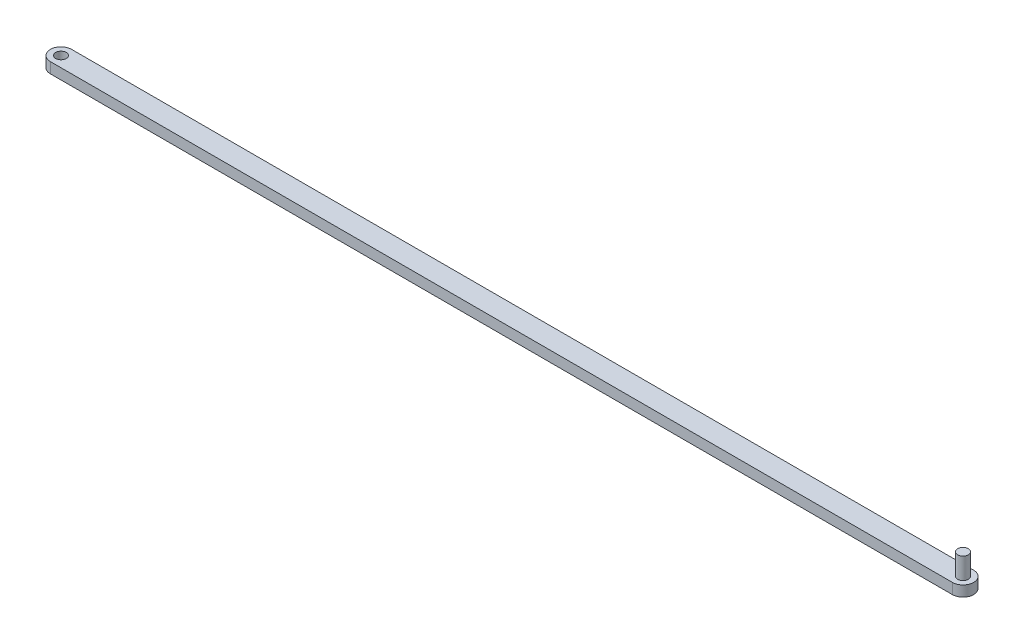
ISO-10303-21;
HEADER;
FILE_DESCRIPTION(('STEP AP214'),'2;1');
FILE_NAME('part.step','',(''),(''),'','','');
FILE_SCHEMA(('AUTOMOTIVE_DESIGN { 1 0 10303 214 1 1 1 1 }'));
ENDSEC;
DATA;
#1=APPLICATION_CONTEXT('core data for automotive mechanical design processes');
#2=APPLICATION_PROTOCOL_DEFINITION('international standard','automotive_design',2000,#1);
#3=PRODUCT_CONTEXT('',#1,'mechanical');
#4=PRODUCT('Part','Part','',(#3));
#5=PRODUCT_RELATED_PRODUCT_CATEGORY('part','',(#4));
#6=PRODUCT_DEFINITION_FORMATION('','',#4);
#7=PRODUCT_DEFINITION_CONTEXT('part definition',#1,'design');
#8=PRODUCT_DEFINITION('design','',#6,#7);
#9=PRODUCT_DEFINITION_SHAPE('','',#8);
#10=(LENGTH_UNIT() NAMED_UNIT(*) SI_UNIT(.MILLI.,.METRE.));
#11=(NAMED_UNIT(*) PLANE_ANGLE_UNIT() SI_UNIT($,.RADIAN.));
#12=(NAMED_UNIT(*) SI_UNIT($,.STERADIAN.) SOLID_ANGLE_UNIT());
#13=UNCERTAINTY_MEASURE_WITH_UNIT(LENGTH_MEASURE(1.E-05),#10,'distance_accuracy_value','');
#14=(GEOMETRIC_REPRESENTATION_CONTEXT(3) GLOBAL_UNCERTAINTY_ASSIGNED_CONTEXT((#13)) GLOBAL_UNIT_ASSIGNED_CONTEXT((#10,
#11,#12)) REPRESENTATION_CONTEXT('',''));
#15=CARTESIAN_POINT('',(0.,0.,0.));
#16=DIRECTION('',(0.,0.,1.));
#17=DIRECTION('',(1.,0.,0.));
#18=AXIS2_PLACEMENT_3D('',#15,#16,#17);
#19=CARTESIAN_POINT('',(-425.,-10.,0.));
#20=DIRECTION('',(0.,1.,0.));
#21=DIRECTION('',(0.,0.,1.));
#22=AXIS2_PLACEMENT_3D('',#19,#20,#21);
#23=CYLINDRICAL_SURFACE('',#22,10.);
#24=CARTESIAN_POINT('',(-425.,0.,0.));
#25=DIRECTION('',(0.,1.,0.));
#26=DIRECTION('',(0.,0.,1.));
#27=AXIS2_PLACEMENT_3D('',#24,#25,#26);
#28=CIRCLE('',#27,10.);
#29=CARTESIAN_POINT('',(-425.,0.,-10.));
#30=VERTEX_POINT('',#29);
#31=CARTESIAN_POINT('',(-425.,0.,10.));
#32=VERTEX_POINT('',#31);
#33=EDGE_CURVE('E99',#30,#32,#28,.T.);
#34=ORIENTED_EDGE('',*,*,#33,.F.);
#35=DIRECTION('',(0.,1.,0.));
#36=VECTOR('',#35,1.);
#37=CARTESIAN_POINT('',(-425.,-10.,-10.));
#38=LINE('',#37,#36);
#39=CARTESIAN_POINT('',(-425.,-10.,-10.));
#40=VERTEX_POINT('',#39);
#41=EDGE_CURVE('E11',#40,#30,#38,.T.);
#42=ORIENTED_EDGE('',*,*,#41,.F.);
#43=CARTESIAN_POINT('',(-425.,-10.,0.));
#44=DIRECTION('',(0.,1.,0.));
#45=DIRECTION('',(0.,0.,1.));
#46=AXIS2_PLACEMENT_3D('',#43,#44,#45);
#47=CIRCLE('',#46,10.);
#48=CARTESIAN_POINT('',(-425.,-10.,10.));
#49=VERTEX_POINT('',#48);
#50=EDGE_CURVE('E92',#40,#49,#47,.T.);
#51=ORIENTED_EDGE('',*,*,#50,.T.);
#52=DIRECTION('',(0.,1.,0.));
#53=VECTOR('',#52,1.);
#54=CARTESIAN_POINT('',(-425.,-10.,10.));
#55=LINE('',#54,#53);
#56=EDGE_CURVE('E37',#49,#32,#55,.T.);
#57=ORIENTED_EDGE('',*,*,#56,.T.);
#58=EDGE_LOOP('',(#34,#42,#51,#57));
#59=FACE_BOUND('',#58,.T.);
#60=ADVANCED_FACE('F34',(#59),#23,.T.);
#61=CARTESIAN_POINT('',(-425.,-10.,-10.));
#62=DIRECTION('',(0.,0.,-1.));
#63=DIRECTION('',(-1.,0.,0.));
#64=AXIS2_PLACEMENT_3D('',#61,#62,#63);
#65=PLANE('',#64);
#66=DIRECTION('',(-1.,0.,0.));
#67=VECTOR('',#66,1.);
#68=CARTESIAN_POINT('',(-425.,0.,-10.));
#69=LINE('',#68,#67);
#70=CARTESIAN_POINT('',(425.,0.,-10.0000000000002));
#71=VERTEX_POINT('',#70);
#72=EDGE_CURVE('E94',#71,#30,#69,.T.);
#73=ORIENTED_EDGE('',*,*,#72,.F.);
#74=DIRECTION('',(0.,1.,0.));
#75=VECTOR('',#74,1.);
#76=CARTESIAN_POINT('',(425.,-10.,-10.0000000000002));
#77=LINE('',#76,#75);
#78=CARTESIAN_POINT('',(425.,-10.,-10.0000000000002));
#79=VERTEX_POINT('',#78);
#80=EDGE_CURVE('E43',#79,#71,#77,.T.);
#81=ORIENTED_EDGE('',*,*,#80,.F.);
#82=DIRECTION('',(-1.,0.,0.));
#83=VECTOR('',#82,1.);
#84=CARTESIAN_POINT('',(-425.,-10.,-10.));
#85=LINE('',#84,#83);
#86=EDGE_CURVE('E89',#79,#40,#85,.T.);
#87=ORIENTED_EDGE('',*,*,#86,.T.);
#88=ORIENTED_EDGE('',*,*,#41,.T.);
#89=EDGE_LOOP('',(#73,#81,#87,#88));
#90=FACE_BOUND('',#89,.T.);
#91=ADVANCED_FACE('F110',(#90),#65,.T.);
#92=CARTESIAN_POINT('',(425.,-10.,0.));
#93=DIRECTION('',(0.,1.,0.));
#94=DIRECTION('',(0.,0.,1.));
#95=AXIS2_PLACEMENT_3D('',#92,#93,#94);
#96=CYLINDRICAL_SURFACE('',#95,10.);
#97=CARTESIAN_POINT('',(425.,0.,0.));
#98=DIRECTION('',(0.,1.,0.));
#99=DIRECTION('',(0.,0.,1.));
#100=AXIS2_PLACEMENT_3D('',#97,#98,#99);
#101=CIRCLE('',#100,10.);
#102=CARTESIAN_POINT('',(425.,0.,10.));
#103=VERTEX_POINT('',#102);
#104=EDGE_CURVE('E84',#103,#71,#101,.T.);
#105=ORIENTED_EDGE('',*,*,#104,.F.);
#106=DIRECTION('',(0.,1.,0.));
#107=VECTOR('',#106,1.);
#108=CARTESIAN_POINT('',(425.,-10.,10.));
#109=LINE('',#108,#107);
#110=CARTESIAN_POINT('',(425.,-10.,10.));
#111=VERTEX_POINT('',#110);
#112=EDGE_CURVE('E79',#111,#103,#109,.T.);
#113=ORIENTED_EDGE('',*,*,#112,.F.);
#114=CARTESIAN_POINT('',(425.,-10.,0.));
#115=DIRECTION('',(0.,1.,0.));
#116=DIRECTION('',(0.,0.,1.));
#117=AXIS2_PLACEMENT_3D('',#114,#115,#116);
#118=CIRCLE('',#117,10.);
#119=EDGE_CURVE('E82',#111,#79,#118,.T.);
#120=ORIENTED_EDGE('',*,*,#119,.T.);
#121=ORIENTED_EDGE('',*,*,#80,.T.);
#122=EDGE_LOOP('',(#105,#113,#120,#121));
#123=FACE_BOUND('',#122,.T.);
#124=ADVANCED_FACE('F81',(#123),#96,.T.);
#125=CARTESIAN_POINT('',(-425.,-10.,10.));
#126=DIRECTION('',(0.,0.,1.));
#127=DIRECTION('',(1.,0.,0.));
#128=AXIS2_PLACEMENT_3D('',#125,#126,#127);
#129=PLANE('',#128);
#130=DIRECTION('',(1.,0.,0.));
#131=VECTOR('',#130,1.);
#132=CARTESIAN_POINT('',(-425.,0.,10.));
#133=LINE('',#132,#131);
#134=EDGE_CURVE('E102',#32,#103,#133,.T.);
#135=ORIENTED_EDGE('',*,*,#134,.F.);
#136=ORIENTED_EDGE('',*,*,#56,.F.);
#137=DIRECTION('',(1.,0.,0.));
#138=VECTOR('',#137,1.);
#139=CARTESIAN_POINT('',(-425.,-10.,10.));
#140=LINE('',#139,#138);
#141=EDGE_CURVE('E88',#49,#111,#140,.T.);
#142=ORIENTED_EDGE('',*,*,#141,.T.);
#143=ORIENTED_EDGE('',*,*,#112,.T.);
#144=EDGE_LOOP('',(#135,#136,#142,#143));
#145=FACE_BOUND('',#144,.T.);
#146=ADVANCED_FACE('F91',(#145),#129,.T.);
#147=CARTESIAN_POINT('',(-425.,-10.,0.));
#148=DIRECTION('',(0.,1.,0.));
#149=DIRECTION('',(0.,0.,1.));
#150=AXIS2_PLACEMENT_3D('',#147,#148,#149);
#151=PLANE('',#150);
#152=CARTESIAN_POINT('',(-425.,-10.,0.));
#153=DIRECTION('',(0.,1.,0.));
#154=DIRECTION('',(0.,0.,1.));
#155=AXIS2_PLACEMENT_3D('',#152,#153,#154);
#156=CIRCLE('',#155,4.99999999999999);
#157=CARTESIAN_POINT('',(-425.,-10.,4.99999999999999));
#158=VERTEX_POINT('',#157);
#159=EDGE_CURVE('E103',#158,#158,#156,.T.);
#160=ORIENTED_EDGE('',*,*,#159,.T.);
#161=EDGE_LOOP('',(#160));
#162=FACE_BOUND('',#161,.T.);
#163=ORIENTED_EDGE('',*,*,#50,.F.);
#164=ORIENTED_EDGE('',*,*,#86,.F.);
#165=ORIENTED_EDGE('',*,*,#119,.F.);
#166=ORIENTED_EDGE('',*,*,#141,.F.);
#167=EDGE_LOOP('',(#163,#164,#165,#166));
#168=FACE_BOUND('',#167,.T.);
#169=ADVANCED_FACE('F87',(#162,#168),#151,.F.);
#170=CARTESIAN_POINT('',(-425.,0.,0.));
#171=DIRECTION('',(0.,1.,0.));
#172=DIRECTION('',(0.,0.,1.));
#173=AXIS2_PLACEMENT_3D('',#170,#171,#172);
#174=PLANE('',#173);
#175=CARTESIAN_POINT('',(425.,0.,0.));
#176=DIRECTION('',(0.,1.,0.));
#177=DIRECTION('',(0.,0.,1.));
#178=AXIS2_PLACEMENT_3D('',#175,#176,#177);
#179=CIRCLE('',#178,4.99999999999999);
#180=CARTESIAN_POINT('',(425.,0.,4.99999999999999));
#181=VERTEX_POINT('',#180);
#182=EDGE_CURVE('E148',#181,#181,#179,.T.);
#183=ORIENTED_EDGE('',*,*,#182,.F.);
#184=EDGE_LOOP('',(#183));
#185=FACE_BOUND('',#184,.T.);
#186=CARTESIAN_POINT('',(-425.,0.,0.));
#187=DIRECTION('',(0.,1.,0.));
#188=DIRECTION('',(0.,0.,1.));
#189=AXIS2_PLACEMENT_3D('',#186,#187,#188);
#190=CIRCLE('',#189,4.99999999999999);
#191=CARTESIAN_POINT('',(-425.,0.,4.99999999999999));
#192=VERTEX_POINT('',#191);
#193=EDGE_CURVE('E147',#192,#192,#190,.T.);
#194=ORIENTED_EDGE('',*,*,#193,.F.);
#195=EDGE_LOOP('',(#194));
#196=FACE_BOUND('',#195,.T.);
#197=ORIENTED_EDGE('',*,*,#33,.T.);
#198=ORIENTED_EDGE('',*,*,#134,.T.);
#199=ORIENTED_EDGE('',*,*,#104,.T.);
#200=ORIENTED_EDGE('',*,*,#72,.T.);
#201=EDGE_LOOP('',(#197,#198,#199,#200));
#202=FACE_BOUND('',#201,.T.);
#203=ADVANCED_FACE('F109',(#185,#196,#202),#174,.T.);
#204=CARTESIAN_POINT('',(-425.,-10.,0.));
#205=DIRECTION('',(0.,1.,0.));
#206=DIRECTION('',(0.,0.,1.));
#207=AXIS2_PLACEMENT_3D('',#204,#205,#206);
#208=CYLINDRICAL_SURFACE('',#207,4.99999999999999);
#209=ORIENTED_EDGE('',*,*,#159,.F.);
#210=EDGE_LOOP('',(#209));
#211=FACE_BOUND('',#210,.T.);
#212=ORIENTED_EDGE('',*,*,#193,.T.);
#213=EDGE_LOOP('',(#212));
#214=FACE_BOUND('',#213,.T.);
#215=ADVANCED_FACE('F128',(#211,#214),#208,.F.);
#216=CARTESIAN_POINT('',(425.,20.,0.));
#217=DIRECTION('',(0.,-1.,0.));
#218=DIRECTION('',(0.,0.,-1.));
#219=AXIS2_PLACEMENT_3D('',#216,#217,#218);
#220=CYLINDRICAL_SURFACE('',#219,4.99999999999999);
#221=CARTESIAN_POINT('',(425.,20.,0.));
#222=DIRECTION('',(0.,1.,0.));
#223=DIRECTION('',(0.,0.,1.));
#224=AXIS2_PLACEMENT_3D('',#221,#222,#223);
#225=CIRCLE('',#224,4.99999999999999);
#226=CARTESIAN_POINT('',(425.,20.,4.99999999999999));
#227=VERTEX_POINT('',#226);
#228=EDGE_CURVE('E146',#227,#227,#225,.T.);
#229=ORIENTED_EDGE('',*,*,#228,.F.);
#230=EDGE_LOOP('',(#229));
#231=FACE_BOUND('',#230,.T.);
#232=ORIENTED_EDGE('',*,*,#182,.T.);
#233=EDGE_LOOP('',(#232));
#234=FACE_BOUND('',#233,.T.);
#235=ADVANCED_FACE('F134',(#231,#234),#220,.T.);
#236=CARTESIAN_POINT('',(425.,20.,0.));
#237=DIRECTION('',(0.,1.,0.));
#238=DIRECTION('',(0.,0.,1.));
#239=AXIS2_PLACEMENT_3D('',#236,#237,#238);
#240=PLANE('',#239);
#241=ORIENTED_EDGE('',*,*,#228,.T.);
#242=EDGE_LOOP('',(#241));
#243=FACE_BOUND('',#242,.T.);
#244=ADVANCED_FACE('F138',(#243),#240,.T.);
#245=CLOSED_SHELL('',(#60,#91,#124,#146,#169,#203,#215,#235,#244));
#246=MANIFOLD_SOLID_BREP('B2',#245);
#247=ADVANCED_BREP_SHAPE_REPRESENTATION('',(#18,#246),#14);
#248=SHAPE_DEFINITION_REPRESENTATION(#9,#247);
ENDSEC;
END-ISO-10303-21;
